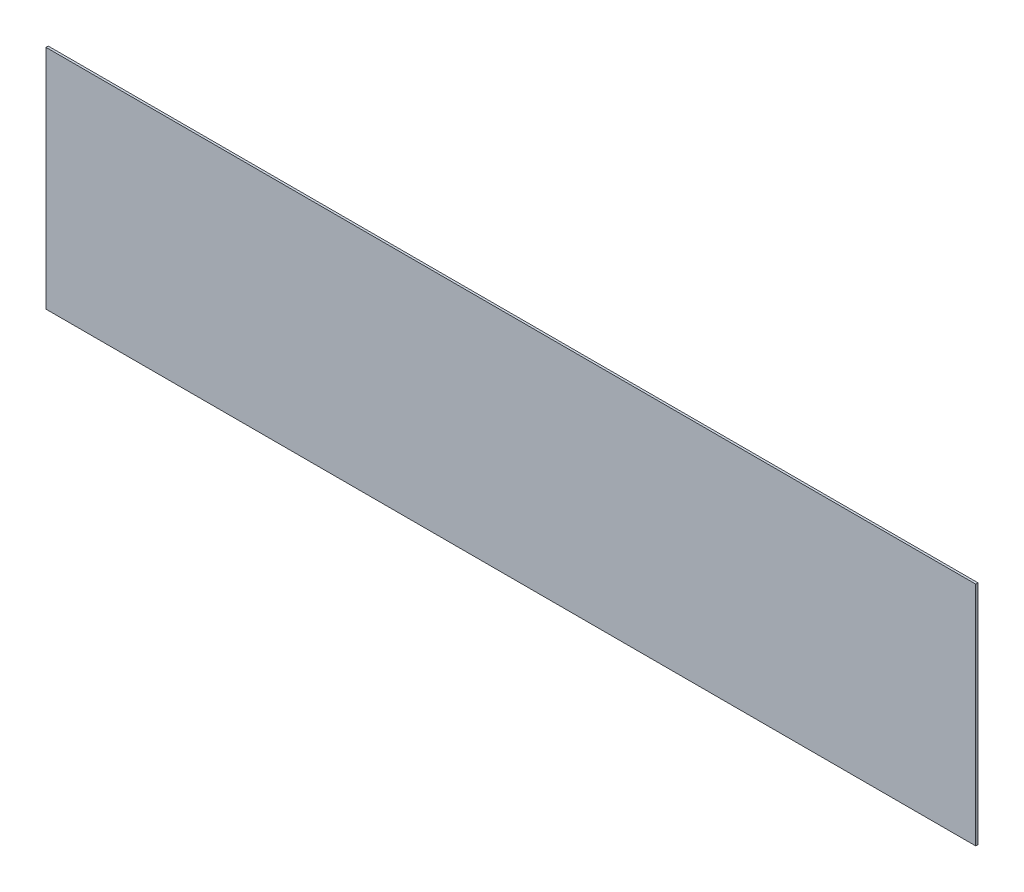
ISO-10303-21;
HEADER;
FILE_DESCRIPTION(('STEP AP214'),'2;1');
FILE_NAME('part.step','',(''),(''),'','','');
FILE_SCHEMA(('AUTOMOTIVE_DESIGN { 1 0 10303 214 1 1 1 1 }'));
ENDSEC;
DATA;
#1=APPLICATION_CONTEXT('core data for automotive mechanical design processes');
#2=APPLICATION_PROTOCOL_DEFINITION('international standard','automotive_design',2000,#1);
#3=PRODUCT_CONTEXT('',#1,'mechanical');
#4=PRODUCT('Part','Part','',(#3));
#5=PRODUCT_RELATED_PRODUCT_CATEGORY('part','',(#4));
#6=PRODUCT_DEFINITION_FORMATION('','',#4);
#7=PRODUCT_DEFINITION_CONTEXT('part definition',#1,'design');
#8=PRODUCT_DEFINITION('design','',#6,#7);
#9=PRODUCT_DEFINITION_SHAPE('','',#8);
#10=(LENGTH_UNIT() NAMED_UNIT(*) SI_UNIT(.MILLI.,.METRE.));
#11=(NAMED_UNIT(*) PLANE_ANGLE_UNIT() SI_UNIT($,.RADIAN.));
#12=(NAMED_UNIT(*) SI_UNIT($,.STERADIAN.) SOLID_ANGLE_UNIT());
#13=UNCERTAINTY_MEASURE_WITH_UNIT(LENGTH_MEASURE(1.E-05),#10,'distance_accuracy_value','');
#14=(GEOMETRIC_REPRESENTATION_CONTEXT(3) GLOBAL_UNCERTAINTY_ASSIGNED_CONTEXT((#13)) GLOBAL_UNIT_ASSIGNED_CONTEXT((#10,
#11,#12)) REPRESENTATION_CONTEXT('',''));
#15=CARTESIAN_POINT('',(0.,0.,0.));
#16=DIRECTION('',(0.,0.,1.));
#17=DIRECTION('',(1.,0.,0.));
#18=AXIS2_PLACEMENT_3D('',#15,#16,#17);
#19=CARTESIAN_POINT('',(820.,-200.,4.));
#20=DIRECTION('',(-1.,0.,0.));
#21=DIRECTION('',(0.,0.,1.));
#22=AXIS2_PLACEMENT_3D('',#19,#20,#21);
#23=PLANE('',#22);
#24=DIRECTION('',(0.,1.,0.));
#25=VECTOR('',#24,1.);
#26=CARTESIAN_POINT('',(820.,-200.,0.));
#27=LINE('',#26,#25);
#28=CARTESIAN_POINT('',(820.,-200.,0.));
#29=VERTEX_POINT('',#28);
#30=CARTESIAN_POINT('',(820.,200.,0.));
#31=VERTEX_POINT('',#30);
#32=EDGE_CURVE('E107',#29,#31,#27,.T.);
#33=ORIENTED_EDGE('',*,*,#32,.T.);
#34=DIRECTION('',(0.,0.,-1.));
#35=VECTOR('',#34,1.);
#36=CARTESIAN_POINT('',(820.,200.,4.));
#37=LINE('',#36,#35);
#38=CARTESIAN_POINT('',(820.,200.,4.));
#39=VERTEX_POINT('',#38);
#40=EDGE_CURVE('E11',#39,#31,#37,.T.);
#41=ORIENTED_EDGE('',*,*,#40,.F.);
#42=DIRECTION('',(0.,1.,0.));
#43=VECTOR('',#42,1.);
#44=CARTESIAN_POINT('',(820.,-200.,4.));
#45=LINE('',#44,#43);
#46=CARTESIAN_POINT('',(820.,-200.,4.));
#47=VERTEX_POINT('',#46);
#48=EDGE_CURVE('E91',#47,#39,#45,.T.);
#49=ORIENTED_EDGE('',*,*,#48,.F.);
#50=DIRECTION('',(0.,0.,-1.));
#51=VECTOR('',#50,1.);
#52=CARTESIAN_POINT('',(820.,-200.,4.));
#53=LINE('',#52,#51);
#54=EDGE_CURVE('E103',#47,#29,#53,.T.);
#55=ORIENTED_EDGE('',*,*,#54,.T.);
#56=EDGE_LOOP('',(#33,#41,#49,#55));
#57=FACE_BOUND('',#56,.T.);
#58=ADVANCED_FACE('F39',(#57),#23,.F.);
#59=CARTESIAN_POINT('',(-820.,200.,4.));
#60=DIRECTION('',(0.,-1.,0.));
#61=DIRECTION('',(0.,0.,-1.));
#62=AXIS2_PLACEMENT_3D('',#59,#60,#61);
#63=PLANE('',#62);
#64=DIRECTION('',(-1.,0.,0.));
#65=VECTOR('',#64,1.);
#66=CARTESIAN_POINT('',(-820.,200.,0.));
#67=LINE('',#66,#65);
#68=CARTESIAN_POINT('',(-820.,200.,0.));
#69=VERTEX_POINT('',#68);
#70=EDGE_CURVE('E96',#31,#69,#67,.T.);
#71=ORIENTED_EDGE('',*,*,#70,.T.);
#72=DIRECTION('',(0.,0.,-1.));
#73=VECTOR('',#72,1.);
#74=CARTESIAN_POINT('',(-820.,200.,4.));
#75=LINE('',#74,#73);
#76=CARTESIAN_POINT('',(-820.,200.,4.));
#77=VERTEX_POINT('',#76);
#78=EDGE_CURVE('E48',#77,#69,#75,.T.);
#79=ORIENTED_EDGE('',*,*,#78,.F.);
#80=DIRECTION('',(-1.,0.,0.));
#81=VECTOR('',#80,1.);
#82=CARTESIAN_POINT('',(-820.,200.,4.));
#83=LINE('',#82,#81);
#84=EDGE_CURVE('E86',#39,#77,#83,.T.);
#85=ORIENTED_EDGE('',*,*,#84,.F.);
#86=ORIENTED_EDGE('',*,*,#40,.T.);
#87=EDGE_LOOP('',(#71,#79,#85,#86));
#88=FACE_BOUND('',#87,.T.);
#89=ADVANCED_FACE('F95',(#88),#63,.F.);
#90=CARTESIAN_POINT('',(-820.,-200.,4.));
#91=DIRECTION('',(1.,0.,0.));
#92=DIRECTION('',(0.,0.,-1.));
#93=AXIS2_PLACEMENT_3D('',#90,#91,#92);
#94=PLANE('',#93);
#95=DIRECTION('',(0.,-1.,0.));
#96=VECTOR('',#95,1.);
#97=CARTESIAN_POINT('',(-820.,-200.,0.));
#98=LINE('',#97,#96);
#99=CARTESIAN_POINT('',(-820.,-200.,0.));
#100=VERTEX_POINT('',#99);
#101=EDGE_CURVE('E73',#69,#100,#98,.T.);
#102=ORIENTED_EDGE('',*,*,#101,.T.);
#103=DIRECTION('',(0.,0.,-1.));
#104=VECTOR('',#103,1.);
#105=CARTESIAN_POINT('',(-820.,-200.,4.));
#106=LINE('',#105,#104);
#107=CARTESIAN_POINT('',(-820.,-200.,4.));
#108=VERTEX_POINT('',#107);
#109=EDGE_CURVE('E98',#108,#100,#106,.T.);
#110=ORIENTED_EDGE('',*,*,#109,.F.);
#111=DIRECTION('',(0.,-1.,0.));
#112=VECTOR('',#111,1.);
#113=CARTESIAN_POINT('',(-820.,-200.,4.));
#114=LINE('',#113,#112);
#115=EDGE_CURVE('E89',#77,#108,#114,.T.);
#116=ORIENTED_EDGE('',*,*,#115,.F.);
#117=ORIENTED_EDGE('',*,*,#78,.T.);
#118=EDGE_LOOP('',(#102,#110,#116,#117));
#119=FACE_BOUND('',#118,.T.);
#120=ADVANCED_FACE('F99',(#119),#94,.F.);
#121=CARTESIAN_POINT('',(-820.,-200.,4.));
#122=DIRECTION('',(0.,1.,0.));
#123=DIRECTION('',(0.,0.,1.));
#124=AXIS2_PLACEMENT_3D('',#121,#122,#123);
#125=PLANE('',#124);
#126=DIRECTION('',(1.,0.,0.));
#127=VECTOR('',#126,1.);
#128=CARTESIAN_POINT('',(-820.,-200.,0.));
#129=LINE('',#128,#127);
#130=EDGE_CURVE('E79',#100,#29,#129,.T.);
#131=ORIENTED_EDGE('',*,*,#130,.T.);
#132=ORIENTED_EDGE('',*,*,#54,.F.);
#133=DIRECTION('',(1.,0.,0.));
#134=VECTOR('',#133,1.);
#135=CARTESIAN_POINT('',(-820.,-200.,4.));
#136=LINE('',#135,#134);
#137=EDGE_CURVE('E56',#108,#47,#136,.T.);
#138=ORIENTED_EDGE('',*,*,#137,.F.);
#139=ORIENTED_EDGE('',*,*,#109,.T.);
#140=EDGE_LOOP('',(#131,#132,#138,#139));
#141=FACE_BOUND('',#140,.T.);
#142=ADVANCED_FACE('F120',(#141),#125,.F.);
#143=CARTESIAN_POINT('',(0.,0.,4.));
#144=DIRECTION('',(0.,0.,-1.));
#145=DIRECTION('',(-1.,0.,0.));
#146=AXIS2_PLACEMENT_3D('',#143,#144,#145);
#147=PLANE('',#146);
#148=ORIENTED_EDGE('',*,*,#48,.T.);
#149=ORIENTED_EDGE('',*,*,#84,.T.);
#150=ORIENTED_EDGE('',*,*,#115,.T.);
#151=ORIENTED_EDGE('',*,*,#137,.T.);
#152=EDGE_LOOP('',(#148,#149,#150,#151));
#153=FACE_BOUND('',#152,.T.);
#154=ADVANCED_FACE('F87',(#153),#147,.F.);
#155=CARTESIAN_POINT('',(0.,0.,0.));
#156=DIRECTION('',(0.,0.,-1.));
#157=DIRECTION('',(-1.,0.,0.));
#158=AXIS2_PLACEMENT_3D('',#155,#156,#157);
#159=PLANE('',#158);
#160=ORIENTED_EDGE('',*,*,#32,.F.);
#161=ORIENTED_EDGE('',*,*,#130,.F.);
#162=ORIENTED_EDGE('',*,*,#101,.F.);
#163=ORIENTED_EDGE('',*,*,#70,.F.);
#164=EDGE_LOOP('',(#160,#161,#162,#163));
#165=FACE_BOUND('',#164,.T.);
#166=ADVANCED_FACE('F123',(#165),#159,.T.);
#167=CLOSED_SHELL('',(#58,#89,#120,#142,#154,#166));
#168=MANIFOLD_SOLID_BREP('B2',#167);
#169=ADVANCED_BREP_SHAPE_REPRESENTATION('',(#18,#168),#14);
#170=SHAPE_DEFINITION_REPRESENTATION(#9,#169);
ENDSEC;
END-ISO-10303-21;
